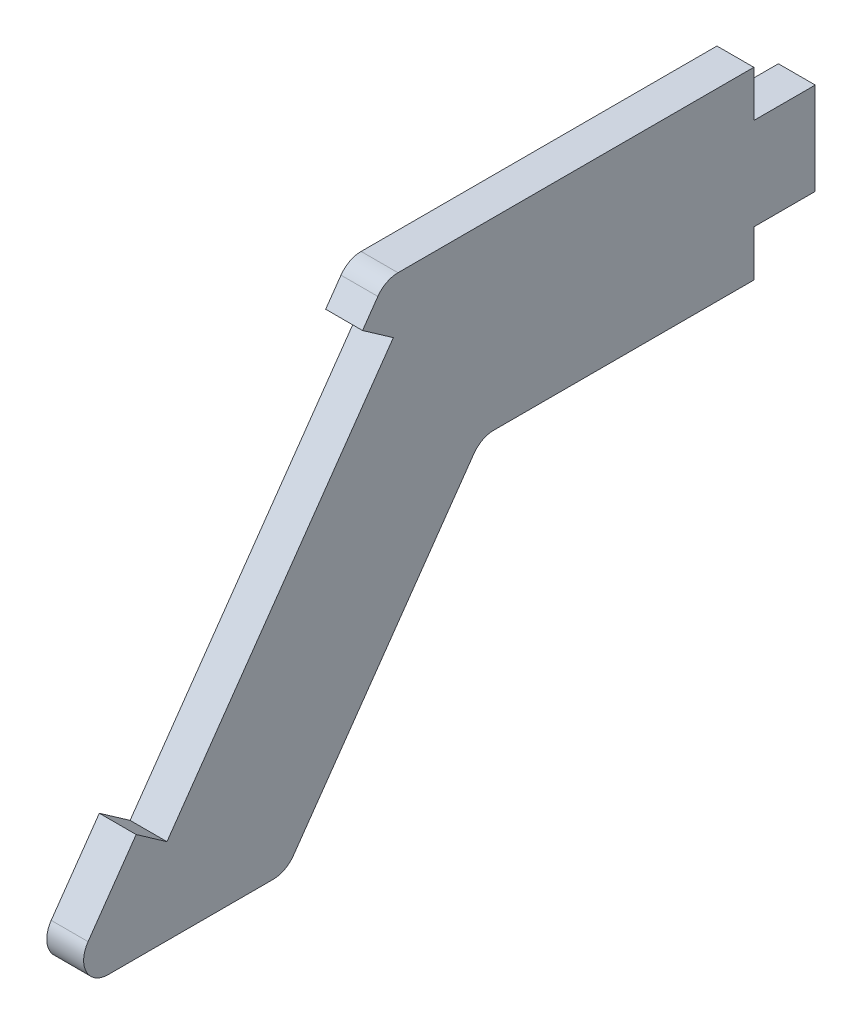
ISO-10303-21;
HEADER;
FILE_DESCRIPTION(('STEP AP214'),'2;1');
FILE_NAME('part.step','',(''),(''),'','','');
FILE_SCHEMA(('AUTOMOTIVE_DESIGN { 1 0 10303 214 1 1 1 1 }'));
ENDSEC;
DATA;
#1=APPLICATION_CONTEXT('core data for automotive mechanical design processes');
#2=APPLICATION_PROTOCOL_DEFINITION('international standard','automotive_design',2000,#1);
#3=PRODUCT_CONTEXT('',#1,'mechanical');
#4=PRODUCT('Part','Part','',(#3));
#5=PRODUCT_RELATED_PRODUCT_CATEGORY('part','',(#4));
#6=PRODUCT_DEFINITION_FORMATION('','',#4);
#7=PRODUCT_DEFINITION_CONTEXT('part definition',#1,'design');
#8=PRODUCT_DEFINITION('design','',#6,#7);
#9=PRODUCT_DEFINITION_SHAPE('','',#8);
#10=(LENGTH_UNIT() NAMED_UNIT(*) SI_UNIT(.MILLI.,.METRE.));
#11=(NAMED_UNIT(*) PLANE_ANGLE_UNIT() SI_UNIT($,.RADIAN.));
#12=(NAMED_UNIT(*) SI_UNIT($,.STERADIAN.) SOLID_ANGLE_UNIT());
#13=UNCERTAINTY_MEASURE_WITH_UNIT(LENGTH_MEASURE(1.E-05),#10,'distance_accuracy_value','');
#14=(GEOMETRIC_REPRESENTATION_CONTEXT(3) GLOBAL_UNCERTAINTY_ASSIGNED_CONTEXT((#13)) GLOBAL_UNIT_ASSIGNED_CONTEXT((#10,
#11,#12)) REPRESENTATION_CONTEXT('',''));
#15=CARTESIAN_POINT('',(0.,0.,0.));
#16=DIRECTION('',(0.,0.,1.));
#17=DIRECTION('',(1.,0.,0.));
#18=AXIS2_PLACEMENT_3D('',#15,#16,#17);
#19=CARTESIAN_POINT('',(3.,-100.457281175035,30.5971699874745));
#20=DIRECTION('',(0.,-0.573576436351044,-0.819152044288993));
#21=DIRECTION('',(0.,0.819152044288993,-0.573576436351044));
#22=AXIS2_PLACEMENT_3D('',#19,#20,#21);
#23=PLANE('',#22);
#24=DIRECTION('',(0.,-0.819152044288993,0.573576436351044));
#25=VECTOR('',#24,1.);
#26=CARTESIAN_POINT('',(3.,-100.457281175035,30.5971699874745));
#27=LINE('',#26,#25);
#28=CARTESIAN_POINT('',(3.,-128.547545188533,50.2661846000265));
#29=VERTEX_POINT('',#28);
#30=CARTESIAN_POINT('',(3.,-134.138275212329,54.1808559067837));
#31=VERTEX_POINT('',#30);
#32=EDGE_CURVE('E264',#29,#31,#27,.T.);
#33=ORIENTED_EDGE('',*,*,#32,.F.);
#34=DIRECTION('',(-1.,0.,0.));
#35=VECTOR('',#34,1.);
#36=CARTESIAN_POINT('',(38.011105568311,-128.547545188533,50.2661846000265));
#37=LINE('',#36,#35);
#38=CARTESIAN_POINT('',(0.,-128.547545188533,50.2661846000265));
#39=VERTEX_POINT('',#38);
#40=EDGE_CURVE('E305',#29,#39,#37,.T.);
#41=ORIENTED_EDGE('',*,*,#40,.T.);
#42=DIRECTION('',(0.,-0.819152044288993,0.573576436351044));
#43=VECTOR('',#42,1.);
#44=CARTESIAN_POINT('',(0.,-100.457281175035,30.5971699874745));
#45=LINE('',#44,#43);
#46=CARTESIAN_POINT('',(0.,-134.138275212329,54.1808559067837));
#47=VERTEX_POINT('',#46);
#48=EDGE_CURVE('E193',#39,#47,#45,.T.);
#49=ORIENTED_EDGE('',*,*,#48,.T.);
#50=DIRECTION('',(-1.,0.,0.));
#51=VECTOR('',#50,1.);
#52=CARTESIAN_POINT('',(3.,-134.138275212329,54.1808559067837));
#53=LINE('',#52,#51);
#54=EDGE_CURVE('E237',#31,#47,#53,.T.);
#55=ORIENTED_EDGE('',*,*,#54,.F.);
#56=EDGE_LOOP('',(#33,#41,#49,#55));
#57=FACE_BOUND('',#56,.T.);
#58=ADVANCED_FACE('F39',(#57),#23,.F.);
#59=CARTESIAN_POINT('',(3.,-99.6044340477375,0.));
#60=DIRECTION('',(0.,0.,1.));
#61=DIRECTION('',(0.,-1.,0.));
#62=AXIS2_PLACEMENT_3D('',#59,#60,#61);
#63=PLANE('',#62);
#64=DIRECTION('',(0.,1.,0.));
#65=VECTOR('',#64,1.);
#66=CARTESIAN_POINT('',(0.,-99.6044340477375,0.));
#67=LINE('',#66,#65);
#68=CARTESIAN_POINT('',(0.,-103.354434047738,0.));
#69=VERTEX_POINT('',#68);
#70=CARTESIAN_POINT('',(0.,-99.6044340477375,0.));
#71=VERTEX_POINT('',#70);
#72=EDGE_CURVE('E185',#69,#71,#67,.T.);
#73=ORIENTED_EDGE('',*,*,#72,.T.);
#74=DIRECTION('',(-1.,0.,0.));
#75=VECTOR('',#74,1.);
#76=CARTESIAN_POINT('',(3.,-99.6044340477375,0.));
#77=LINE('',#76,#75);
#78=CARTESIAN_POINT('',(3.,-99.6044340477375,0.));
#79=VERTEX_POINT('',#78);
#80=EDGE_CURVE('E11',#79,#71,#77,.T.);
#81=ORIENTED_EDGE('',*,*,#80,.F.);
#82=DIRECTION('',(0.,1.,0.));
#83=VECTOR('',#82,1.);
#84=CARTESIAN_POINT('',(3.,-99.6044340477375,0.));
#85=LINE('',#84,#83);
#86=CARTESIAN_POINT('',(3.,-103.354434047738,0.));
#87=VERTEX_POINT('',#86);
#88=EDGE_CURVE('E215',#87,#79,#85,.T.);
#89=ORIENTED_EDGE('',*,*,#88,.F.);
#90=DIRECTION('',(-1.,0.,0.));
#91=VECTOR('',#90,1.);
#92=CARTESIAN_POINT('',(3.,-103.354434047738,0.));
#93=LINE('',#92,#91);
#94=EDGE_CURVE('E181',#87,#69,#93,.T.);
#95=ORIENTED_EDGE('',*,*,#94,.T.);
#96=EDGE_LOOP('',(#73,#81,#89,#95));
#97=FACE_BOUND('',#96,.T.);
#98=ADVANCED_FACE('F41',(#97),#63,.F.);
#99=CARTESIAN_POINT('',(3.,-99.6044340477375,0.));
#100=DIRECTION('',(0.,-1.,0.));
#101=DIRECTION('',(0.,0.,-1.));
#102=AXIS2_PLACEMENT_3D('',#99,#100,#101);
#103=PLANE('',#102);
#104=DIRECTION('',(0.,0.,1.));
#105=VECTOR('',#104,1.);
#106=CARTESIAN_POINT('',(0.,-99.6044340477375,0.));
#107=LINE('',#106,#105);
#108=CARTESIAN_POINT('',(0.,-99.6044340477375,28.9588658988965));
#109=VERTEX_POINT('',#108);
#110=EDGE_CURVE('E188',#71,#109,#107,.T.);
#111=ORIENTED_EDGE('',*,*,#110,.T.);
#112=DIRECTION('',(-1.,0.,0.));
#113=VECTOR('',#112,1.);
#114=CARTESIAN_POINT('',(3.,-99.6044340477375,28.9588658988965));
#115=LINE('',#114,#113);
#116=CARTESIAN_POINT('',(3.,-99.6044340477375,28.9588658988965));
#117=VERTEX_POINT('',#116);
#118=EDGE_CURVE('E47',#117,#109,#115,.T.);
#119=ORIENTED_EDGE('',*,*,#118,.F.);
#120=DIRECTION('',(0.,0.,1.));
#121=VECTOR('',#120,1.);
#122=CARTESIAN_POINT('',(3.,-99.6044340477375,0.));
#123=LINE('',#122,#121);
#124=EDGE_CURVE('E122',#79,#117,#123,.T.);
#125=ORIENTED_EDGE('',*,*,#124,.F.);
#126=ORIENTED_EDGE('',*,*,#80,.T.);
#127=EDGE_LOOP('',(#111,#119,#125,#126));
#128=FACE_BOUND('',#127,.T.);
#129=ADVANCED_FACE('F376',(#128),#103,.F.);
#130=CARTESIAN_POINT('',(3.,-101.604434047738,28.9588658988965));
#131=DIRECTION('',(-1.,0.,0.));
#132=DIRECTION('',(0.,0.,1.));
#133=AXIS2_PLACEMENT_3D('',#130,#131,#132);
#134=CYLINDRICAL_SURFACE('',#133,2.);
#135=CARTESIAN_POINT('',(0.,-101.604434047738,28.9588658988965));
#136=DIRECTION('',(1.,0.,0.));
#137=DIRECTION('',(0.,0.,-1.));
#138=AXIS2_PLACEMENT_3D('',#135,#136,#137);
#139=CIRCLE('',#138,2.);
#140=CARTESIAN_POINT('',(0.,-100.457281175035,30.5971699874745));
#141=VERTEX_POINT('',#140);
#142=EDGE_CURVE('E191',#109,#141,#139,.T.);
#143=ORIENTED_EDGE('',*,*,#142,.T.);
#144=DIRECTION('',(-1.,0.,0.));
#145=VECTOR('',#144,1.);
#146=CARTESIAN_POINT('',(3.,-100.457281175035,30.5971699874745));
#147=LINE('',#146,#145);
#148=CARTESIAN_POINT('',(3.,-100.457281175035,30.5971699874745));
#149=VERTEX_POINT('',#148);
#150=EDGE_CURVE('E240',#149,#141,#147,.T.);
#151=ORIENTED_EDGE('',*,*,#150,.F.);
#152=CARTESIAN_POINT('',(3.,-101.604434047738,28.9588658988965));
#153=DIRECTION('',(1.,0.,0.));
#154=DIRECTION('',(0.,0.,-1.));
#155=AXIS2_PLACEMENT_3D('',#152,#153,#154);
#156=CIRCLE('',#155,2.);
#157=EDGE_CURVE('E248',#117,#149,#156,.T.);
#158=ORIENTED_EDGE('',*,*,#157,.F.);
#159=ORIENTED_EDGE('',*,*,#118,.T.);
#160=EDGE_LOOP('',(#143,#151,#158,#159));
#161=FACE_BOUND('',#160,.T.);
#162=ADVANCED_FACE('F246',(#161),#134,.T.);
#163=CARTESIAN_POINT('',(0.,-102.236381525971,31.8429094644309));
#164=VERTEX_POINT('',#163);
#165=EDGE_CURVE('E194',#141,#164,#45,.T.);
#166=ORIENTED_EDGE('',*,*,#165,.T.);
#167=DIRECTION('',(-1.,0.,0.));
#168=VECTOR('',#167,1.);
#169=CARTESIAN_POINT('',(38.011105568311,-102.236381525971,31.8429094644309));
#170=LINE('',#169,#168);
#171=CARTESIAN_POINT('',(3.,-102.236381525971,31.8429094644309));
#172=VERTEX_POINT('',#171);
#173=EDGE_CURVE('E54',#172,#164,#170,.T.);
#174=ORIENTED_EDGE('',*,*,#173,.F.);
#175=EDGE_CURVE('E261',#149,#172,#27,.T.);
#176=ORIENTED_EDGE('',*,*,#175,.F.);
#177=ORIENTED_EDGE('',*,*,#150,.T.);
#178=EDGE_LOOP('',(#166,#174,#176,#177));
#179=FACE_BOUND('',#178,.T.);
#180=ADVANCED_FACE('F257',(#179),#23,.F.);
#181=CARTESIAN_POINT('',(3.,-135.285428085031,52.5425518182057));
#182=DIRECTION('',(-1.,0.,0.));
#183=DIRECTION('',(0.,0.,1.));
#184=AXIS2_PLACEMENT_3D('',#181,#182,#183);
#185=CYLINDRICAL_SURFACE('',#184,2.);
#186=CARTESIAN_POINT('',(0.,-135.285428085031,52.5425518182057));
#187=DIRECTION('',(1.,0.,0.));
#188=DIRECTION('',(0.,0.,-1.));
#189=AXIS2_PLACEMENT_3D('',#186,#187,#188);
#190=CIRCLE('',#189,2.);
#191=CARTESIAN_POINT('',(0.,-137.285428085031,52.5425518182057));
#192=VERTEX_POINT('',#191);
#193=EDGE_CURVE('E197',#47,#192,#190,.T.);
#194=ORIENTED_EDGE('',*,*,#193,.T.);
#195=DIRECTION('',(-1.,0.,0.));
#196=VECTOR('',#195,1.);
#197=CARTESIAN_POINT('',(3.,-137.285428085031,52.5425518182057));
#198=LINE('',#197,#196);
#199=CARTESIAN_POINT('',(3.,-137.285428085031,52.5425518182057));
#200=VERTEX_POINT('',#199);
#201=EDGE_CURVE('E234',#200,#192,#198,.T.);
#202=ORIENTED_EDGE('',*,*,#201,.F.);
#203=CARTESIAN_POINT('',(3.,-135.285428085031,52.5425518182057));
#204=DIRECTION('',(1.,0.,0.));
#205=DIRECTION('',(0.,0.,-1.));
#206=AXIS2_PLACEMENT_3D('',#203,#204,#205);
#207=CIRCLE('',#206,2.);
#208=EDGE_CURVE('E263',#31,#200,#207,.T.);
#209=ORIENTED_EDGE('',*,*,#208,.F.);
#210=ORIENTED_EDGE('',*,*,#54,.T.);
#211=EDGE_LOOP('',(#194,#202,#209,#210));
#212=FACE_BOUND('',#211,.T.);
#213=ADVANCED_FACE('F344',(#212),#185,.T.);
#214=CARTESIAN_POINT('',(3.,-137.285428085031,52.5425518182057));
#215=DIRECTION('',(0.,1.,0.));
#216=DIRECTION('',(0.,0.,1.));
#217=AXIS2_PLACEMENT_3D('',#214,#215,#216);
#218=PLANE('',#217);
#219=DIRECTION('',(0.,0.,-1.));
#220=VECTOR('',#219,1.);
#221=CARTESIAN_POINT('',(0.,-137.285428085031,52.5425518182057));
#222=LINE('',#221,#220);
#223=CARTESIAN_POINT('',(0.,-137.285428085031,39.1140313418297));
#224=VERTEX_POINT('',#223);
#225=EDGE_CURVE('E199',#192,#224,#222,.T.);
#226=ORIENTED_EDGE('',*,*,#225,.T.);
#227=DIRECTION('',(-1.,0.,0.));
#228=VECTOR('',#227,1.);
#229=CARTESIAN_POINT('',(3.,-137.285428085031,39.1140313418297));
#230=LINE('',#229,#228);
#231=CARTESIAN_POINT('',(3.,-137.285428085031,39.1140313418297));
#232=VERTEX_POINT('',#231);
#233=EDGE_CURVE('E231',#232,#224,#230,.T.);
#234=ORIENTED_EDGE('',*,*,#233,.F.);
#235=DIRECTION('',(0.,0.,-1.));
#236=VECTOR('',#235,1.);
#237=CARTESIAN_POINT('',(3.,-137.285428085031,52.5425518182057));
#238=LINE('',#237,#236);
#239=EDGE_CURVE('E266',#200,#232,#238,.T.);
#240=ORIENTED_EDGE('',*,*,#239,.F.);
#241=ORIENTED_EDGE('',*,*,#201,.T.);
#242=EDGE_LOOP('',(#226,#234,#240,#241));
#243=FACE_BOUND('',#242,.T.);
#244=ADVANCED_FACE('F350',(#243),#218,.F.);
#245=CARTESIAN_POINT('',(3.,-135.285428085031,39.1140313418297));
#246=DIRECTION('',(-1.,0.,0.));
#247=DIRECTION('',(0.,0.,1.));
#248=AXIS2_PLACEMENT_3D('',#245,#246,#247);
#249=CYLINDRICAL_SURFACE('',#248,1.99999999999999);
#250=CARTESIAN_POINT('',(0.,-135.285428085031,39.1140313418297));
#251=DIRECTION('',(1.,0.,0.));
#252=DIRECTION('',(0.,0.,-1.));
#253=AXIS2_PLACEMENT_3D('',#250,#251,#252);
#254=CIRCLE('',#253,1.99999999999999);
#255=CARTESIAN_POINT('',(0.,-136.432580957733,37.4757272532517));
#256=VERTEX_POINT('',#255);
#257=EDGE_CURVE('E201',#224,#256,#254,.T.);
#258=ORIENTED_EDGE('',*,*,#257,.T.);
#259=DIRECTION('',(-1.,0.,0.));
#260=VECTOR('',#259,1.);
#261=CARTESIAN_POINT('',(3.,-136.432580957733,37.4757272532517));
#262=LINE('',#261,#260);
#263=CARTESIAN_POINT('',(3.,-136.432580957733,37.4757272532517));
#264=VERTEX_POINT('',#263);
#265=EDGE_CURVE('E228',#264,#256,#262,.T.);
#266=ORIENTED_EDGE('',*,*,#265,.F.);
#267=CARTESIAN_POINT('',(3.,-135.285428085031,39.1140313418297));
#268=DIRECTION('',(1.,0.,0.));
#269=DIRECTION('',(0.,0.,-1.));
#270=AXIS2_PLACEMENT_3D('',#267,#268,#269);
#271=CIRCLE('',#270,1.99999999999999);
#272=EDGE_CURVE('E272',#232,#264,#271,.T.);
#273=ORIENTED_EDGE('',*,*,#272,.F.);
#274=ORIENTED_EDGE('',*,*,#233,.T.);
#275=EDGE_LOOP('',(#258,#266,#273,#274));
#276=FACE_BOUND('',#275,.T.);
#277=ADVANCED_FACE('F354',(#276),#249,.T.);
#278=CARTESIAN_POINT('',(3.,-136.432580957733,37.4757272532517));
#279=DIRECTION('',(0.,0.573576436351043,0.819152044288994));
#280=DIRECTION('',(0.,-0.819152044288994,0.573576436351043));
#281=AXIS2_PLACEMENT_3D('',#278,#279,#280);
#282=PLANE('',#281);
#283=DIRECTION('',(0.,0.819152044288994,-0.573576436351043));
#284=VECTOR('',#283,1.);
#285=CARTESIAN_POINT('',(0.,-136.432580957733,37.4757272532517));
#286=LINE('',#285,#284);
#287=CARTESIAN_POINT('',(0.,-115.457281175035,22.7886642291983));
#288=VERTEX_POINT('',#287);
#289=EDGE_CURVE('E203',#256,#288,#286,.T.);
#290=ORIENTED_EDGE('',*,*,#289,.T.);
#291=DIRECTION('',(-1.,0.,0.));
#292=VECTOR('',#291,1.);
#293=CARTESIAN_POINT('',(3.,-115.457281175035,22.7886642291983));
#294=LINE('',#293,#292);
#295=CARTESIAN_POINT('',(3.,-115.457281175035,22.7886642291983));
#296=VERTEX_POINT('',#295);
#297=EDGE_CURVE('E225',#296,#288,#294,.T.);
#298=ORIENTED_EDGE('',*,*,#297,.F.);
#299=DIRECTION('',(0.,0.819152044288994,-0.573576436351043));
#300=VECTOR('',#299,1.);
#301=CARTESIAN_POINT('',(3.,-136.432580957733,37.4757272532517));
#302=LINE('',#301,#300);
#303=EDGE_CURVE('E274',#264,#296,#302,.T.);
#304=ORIENTED_EDGE('',*,*,#303,.F.);
#305=ORIENTED_EDGE('',*,*,#265,.T.);
#306=EDGE_LOOP('',(#290,#298,#304,#305));
#307=FACE_BOUND('',#306,.T.);
#308=ADVANCED_FACE('F359',(#307),#282,.F.);
#309=CARTESIAN_POINT('',(3.,-116.604434047738,21.1503601406203));
#310=DIRECTION('',(-1.,0.,0.));
#311=DIRECTION('',(0.,0.,1.));
#312=AXIS2_PLACEMENT_3D('',#309,#310,#311);
#313=CYLINDRICAL_SURFACE('',#312,2.00000000000001);
#314=CARTESIAN_POINT('',(0.,-116.604434047738,21.1503601406203));
#315=DIRECTION('',(-1.,0.,0.));
#316=DIRECTION('',(0.,0.,1.));
#317=AXIS2_PLACEMENT_3D('',#314,#315,#316);
#318=CIRCLE('',#317,2.00000000000001);
#319=CARTESIAN_POINT('',(0.,-114.604434047738,21.1503601406203));
#320=VERTEX_POINT('',#319);
#321=EDGE_CURVE('E205',#288,#320,#318,.T.);
#322=ORIENTED_EDGE('',*,*,#321,.T.);
#323=DIRECTION('',(-1.,0.,0.));
#324=VECTOR('',#323,1.);
#325=CARTESIAN_POINT('',(3.,-114.604434047738,21.1503601406203));
#326=LINE('',#325,#324);
#327=CARTESIAN_POINT('',(3.,-114.604434047738,21.1503601406203));
#328=VERTEX_POINT('',#327);
#329=EDGE_CURVE('E222',#328,#320,#326,.T.);
#330=ORIENTED_EDGE('',*,*,#329,.F.);
#331=CARTESIAN_POINT('',(3.,-116.604434047738,21.1503601406203));
#332=DIRECTION('',(-1.,0.,0.));
#333=DIRECTION('',(0.,0.,1.));
#334=AXIS2_PLACEMENT_3D('',#331,#332,#333);
#335=CIRCLE('',#334,2.00000000000001);
#336=EDGE_CURVE('E276',#296,#328,#335,.T.);
#337=ORIENTED_EDGE('',*,*,#336,.F.);
#338=ORIENTED_EDGE('',*,*,#297,.T.);
#339=EDGE_LOOP('',(#322,#330,#337,#338));
#340=FACE_BOUND('',#339,.T.);
#341=ADVANCED_FACE('F362',(#340),#313,.F.);
#342=CARTESIAN_POINT('',(3.,-114.604434047738,21.1503601406203));
#343=DIRECTION('',(0.,1.,0.));
#344=DIRECTION('',(0.,0.,1.));
#345=AXIS2_PLACEMENT_3D('',#342,#343,#344);
#346=PLANE('',#345);
#347=DIRECTION('',(0.,0.,-1.));
#348=VECTOR('',#347,1.);
#349=CARTESIAN_POINT('',(0.,-114.604434047738,21.1503601406203));
#350=LINE('',#349,#348);
#351=CARTESIAN_POINT('',(0.,-114.604434047738,0.));
#352=VERTEX_POINT('',#351);
#353=EDGE_CURVE('E207',#320,#352,#350,.T.);
#354=ORIENTED_EDGE('',*,*,#353,.T.);
#355=DIRECTION('',(-1.,0.,0.));
#356=VECTOR('',#355,1.);
#357=CARTESIAN_POINT('',(3.,-114.604434047738,0.));
#358=LINE('',#357,#356);
#359=CARTESIAN_POINT('',(3.,-114.604434047738,0.));
#360=VERTEX_POINT('',#359);
#361=EDGE_CURVE('E219',#360,#352,#358,.T.);
#362=ORIENTED_EDGE('',*,*,#361,.F.);
#363=DIRECTION('',(0.,0.,-1.));
#364=VECTOR('',#363,1.);
#365=CARTESIAN_POINT('',(3.,-114.604434047738,21.1503601406203));
#366=LINE('',#365,#364);
#367=EDGE_CURVE('E278',#328,#360,#366,.T.);
#368=ORIENTED_EDGE('',*,*,#367,.F.);
#369=ORIENTED_EDGE('',*,*,#329,.T.);
#370=EDGE_LOOP('',(#354,#362,#368,#369));
#371=FACE_BOUND('',#370,.T.);
#372=ADVANCED_FACE('F284',(#371),#346,.F.);
#373=CARTESIAN_POINT('',(3.,-110.854434047738,0.));
#374=DIRECTION('',(0.,0.,1.));
#375=DIRECTION('',(0.,-1.,0.));
#376=AXIS2_PLACEMENT_3D('',#373,#374,#375);
#377=PLANE('',#376);
#378=DIRECTION('',(0.,1.,0.));
#379=VECTOR('',#378,1.);
#380=CARTESIAN_POINT('',(0.,-110.854434047738,0.));
#381=LINE('',#380,#379);
#382=CARTESIAN_POINT('',(0.,-110.854434047738,0.));
#383=VERTEX_POINT('',#382);
#384=EDGE_CURVE('E209',#352,#383,#381,.T.);
#385=ORIENTED_EDGE('',*,*,#384,.T.);
#386=DIRECTION('',(-1.,0.,0.));
#387=VECTOR('',#386,1.);
#388=CARTESIAN_POINT('',(3.,-110.854434047738,0.));
#389=LINE('',#388,#387);
#390=CARTESIAN_POINT('',(3.,-110.854434047738,0.));
#391=VERTEX_POINT('',#390);
#392=EDGE_CURVE('E176',#391,#383,#389,.T.);
#393=ORIENTED_EDGE('',*,*,#392,.F.);
#394=DIRECTION('',(0.,1.,0.));
#395=VECTOR('',#394,1.);
#396=CARTESIAN_POINT('',(3.,-110.854434047738,0.));
#397=LINE('',#396,#395);
#398=EDGE_CURVE('E164',#360,#391,#397,.T.);
#399=ORIENTED_EDGE('',*,*,#398,.F.);
#400=ORIENTED_EDGE('',*,*,#361,.T.);
#401=EDGE_LOOP('',(#385,#393,#399,#400));
#402=FACE_BOUND('',#401,.T.);
#403=ADVANCED_FACE('F288',(#402),#377,.F.);
#404=CARTESIAN_POINT('',(3.,-110.854434047738,0.));
#405=DIRECTION('',(0.,1.,0.));
#406=DIRECTION('',(0.,0.,1.));
#407=AXIS2_PLACEMENT_3D('',#404,#405,#406);
#408=PLANE('',#407);
#409=DIRECTION('',(0.,0.,-1.));
#410=VECTOR('',#409,1.);
#411=CARTESIAN_POINT('',(0.,-110.854434047738,0.));
#412=LINE('',#411,#410);
#413=CARTESIAN_POINT('',(0.,-110.854434047738,-5.));
#414=VERTEX_POINT('',#413);
#415=EDGE_CURVE('E173',#383,#414,#412,.T.);
#416=ORIENTED_EDGE('',*,*,#415,.T.);
#417=DIRECTION('',(-1.,0.,0.));
#418=VECTOR('',#417,1.);
#419=CARTESIAN_POINT('',(3.,-110.854434047738,-5.));
#420=LINE('',#419,#418);
#421=CARTESIAN_POINT('',(3.,-110.854434047738,-5.));
#422=VERTEX_POINT('',#421);
#423=EDGE_CURVE('E170',#422,#414,#420,.T.);
#424=ORIENTED_EDGE('',*,*,#423,.F.);
#425=DIRECTION('',(0.,0.,-1.));
#426=VECTOR('',#425,1.);
#427=CARTESIAN_POINT('',(3.,-110.854434047738,0.));
#428=LINE('',#427,#426);
#429=EDGE_CURVE('E156',#391,#422,#428,.T.);
#430=ORIENTED_EDGE('',*,*,#429,.F.);
#431=ORIENTED_EDGE('',*,*,#392,.T.);
#432=EDGE_LOOP('',(#416,#424,#430,#431));
#433=FACE_BOUND('',#432,.T.);
#434=ADVANCED_FACE('F171',(#433),#408,.F.);
#435=CARTESIAN_POINT('',(3.,-103.354434047738,-5.));
#436=DIRECTION('',(0.,0.,1.));
#437=DIRECTION('',(1.,0.,0.));
#438=AXIS2_PLACEMENT_3D('',#435,#436,#437);
#439=PLANE('',#438);
#440=DIRECTION('',(0.,1.,0.));
#441=VECTOR('',#440,1.);
#442=CARTESIAN_POINT('',(0.,-103.354434047738,-5.));
#443=LINE('',#442,#441);
#444=CARTESIAN_POINT('',(0.,-103.354434047738,-5.));
#445=VERTEX_POINT('',#444);
#446=EDGE_CURVE('E212',#414,#445,#443,.T.);
#447=ORIENTED_EDGE('',*,*,#446,.T.);
#448=DIRECTION('',(-1.,0.,0.));
#449=VECTOR('',#448,1.);
#450=CARTESIAN_POINT('',(3.,-103.354434047738,-5.));
#451=LINE('',#450,#449);
#452=CARTESIAN_POINT('',(3.,-103.354434047738,-5.));
#453=VERTEX_POINT('',#452);
#454=EDGE_CURVE('E177',#453,#445,#451,.T.);
#455=ORIENTED_EDGE('',*,*,#454,.F.);
#456=DIRECTION('',(0.,1.,0.));
#457=VECTOR('',#456,1.);
#458=CARTESIAN_POINT('',(3.,-103.354434047738,-5.));
#459=LINE('',#458,#457);
#460=EDGE_CURVE('E161',#422,#453,#459,.T.);
#461=ORIENTED_EDGE('',*,*,#460,.F.);
#462=ORIENTED_EDGE('',*,*,#423,.T.);
#463=EDGE_LOOP('',(#447,#455,#461,#462));
#464=FACE_BOUND('',#463,.T.);
#465=ADVANCED_FACE('F179',(#464),#439,.F.);
#466=CARTESIAN_POINT('',(3.,-103.354434047738,0.));
#467=DIRECTION('',(0.,-1.,0.));
#468=DIRECTION('',(0.,0.,-1.));
#469=AXIS2_PLACEMENT_3D('',#466,#467,#468);
#470=PLANE('',#469);
#471=DIRECTION('',(0.,0.,1.));
#472=VECTOR('',#471,1.);
#473=CARTESIAN_POINT('',(0.,-103.354434047738,0.));
#474=LINE('',#473,#472);
#475=EDGE_CURVE('E114',#445,#69,#474,.T.);
#476=ORIENTED_EDGE('',*,*,#475,.T.);
#477=ORIENTED_EDGE('',*,*,#94,.F.);
#478=DIRECTION('',(0.,0.,1.));
#479=VECTOR('',#478,1.);
#480=CARTESIAN_POINT('',(3.,-103.354434047738,0.));
#481=LINE('',#480,#479);
#482=EDGE_CURVE('E63',#453,#87,#481,.T.);
#483=ORIENTED_EDGE('',*,*,#482,.F.);
#484=ORIENTED_EDGE('',*,*,#454,.T.);
#485=EDGE_LOOP('',(#476,#477,#483,#484));
#486=FACE_BOUND('',#485,.T.);
#487=ADVANCED_FACE('F289',(#486),#470,.F.);
#488=CARTESIAN_POINT('',(3.,-116.604434047738,21.1503601406203));
#489=DIRECTION('',(-1.,0.,0.));
#490=DIRECTION('',(0.,0.,1.));
#491=AXIS2_PLACEMENT_3D('',#488,#489,#490);
#492=PLANE('',#491);
#493=DIRECTION('',(0.,0.819152044288994,-0.573576436351044));
#494=VECTOR('',#493,1.);
#495=CARTESIAN_POINT('',(3.,-103.991525421205,29.3363042089066));
#496=LINE('',#495,#494);
#497=CARTESIAN_POINT('',(3.,-130.302689083767,47.7595793445021));
#498=VERTEX_POINT('',#497);
#499=CARTESIAN_POINT('',(3.,-103.991525421205,29.3363042089066));
#500=VERTEX_POINT('',#499);
#501=EDGE_CURVE('E308',#498,#500,#496,.T.);
#502=ORIENTED_EDGE('',*,*,#501,.F.);
#503=DIRECTION('',(0.,-0.573576436351053,-0.819152044288987));
#504=VECTOR('',#503,1.);
#505=CARTESIAN_POINT('',(3.,-128.547545188533,50.2661846000265));
#506=LINE('',#505,#504);
#507=EDGE_CURVE('E296',#29,#498,#506,.T.);
#508=ORIENTED_EDGE('',*,*,#507,.F.);
#509=ORIENTED_EDGE('',*,*,#32,.T.);
#510=ORIENTED_EDGE('',*,*,#208,.T.);
#511=ORIENTED_EDGE('',*,*,#239,.T.);
#512=ORIENTED_EDGE('',*,*,#272,.T.);
#513=ORIENTED_EDGE('',*,*,#303,.T.);
#514=ORIENTED_EDGE('',*,*,#336,.T.);
#515=ORIENTED_EDGE('',*,*,#367,.T.);
#516=ORIENTED_EDGE('',*,*,#398,.T.);
#517=ORIENTED_EDGE('',*,*,#429,.T.);
#518=ORIENTED_EDGE('',*,*,#460,.T.);
#519=ORIENTED_EDGE('',*,*,#482,.T.);
#520=ORIENTED_EDGE('',*,*,#88,.T.);
#521=ORIENTED_EDGE('',*,*,#124,.T.);
#522=ORIENTED_EDGE('',*,*,#157,.T.);
#523=ORIENTED_EDGE('',*,*,#175,.T.);
#524=DIRECTION('',(0.,0.573576436351043,0.819152044288994));
#525=VECTOR('',#524,1.);
#526=CARTESIAN_POINT('',(3.,-102.236381525971,31.8429094644309));
#527=LINE('',#526,#525);
#528=EDGE_CURVE('E189',#500,#172,#527,.T.);
#529=ORIENTED_EDGE('',*,*,#528,.F.);
#530=EDGE_LOOP('',(#502,#508,#509,#510,#511,#512,#513,#514,#515,#516,#517,#518,#519,#520,#521,
#522,#523,#529));
#531=FACE_BOUND('',#530,.T.);
#532=ADVANCED_FACE('F159',(#531),#492,.F.);
#533=CARTESIAN_POINT('',(0.,-116.604434047738,21.1503601406203));
#534=DIRECTION('',(-1.,0.,0.));
#535=DIRECTION('',(0.,0.,1.));
#536=AXIS2_PLACEMENT_3D('',#533,#534,#535);
#537=PLANE('',#536);
#538=DIRECTION('',(0.,0.573576436351053,0.819152044288987));
#539=VECTOR('',#538,1.);
#540=CARTESIAN_POINT('',(0.,-128.547545188533,50.2661846000265));
#541=LINE('',#540,#539);
#542=CARTESIAN_POINT('',(0.,-130.302689083767,47.7595793445021));
#543=VERTEX_POINT('',#542);
#544=EDGE_CURVE('E299',#543,#39,#541,.T.);
#545=ORIENTED_EDGE('',*,*,#544,.F.);
#546=DIRECTION('',(0.,-0.819152044288994,0.573576436351043));
#547=VECTOR('',#546,1.);
#548=CARTESIAN_POINT('',(0.,-103.991525421205,29.3363042089066));
#549=LINE('',#548,#547);
#550=CARTESIAN_POINT('',(0.,-103.991525421205,29.3363042089066));
#551=VERTEX_POINT('',#550);
#552=EDGE_CURVE('E311',#551,#543,#549,.T.);
#553=ORIENTED_EDGE('',*,*,#552,.F.);
#554=DIRECTION('',(0.,-0.573576436351043,-0.819152044288994));
#555=VECTOR('',#554,1.);
#556=CARTESIAN_POINT('',(0.,-102.236381525971,31.8429094644309));
#557=LINE('',#556,#555);
#558=EDGE_CURVE('E255',#164,#551,#557,.T.);
#559=ORIENTED_EDGE('',*,*,#558,.F.);
#560=ORIENTED_EDGE('',*,*,#165,.F.);
#561=ORIENTED_EDGE('',*,*,#142,.F.);
#562=ORIENTED_EDGE('',*,*,#110,.F.);
#563=ORIENTED_EDGE('',*,*,#72,.F.);
#564=ORIENTED_EDGE('',*,*,#475,.F.);
#565=ORIENTED_EDGE('',*,*,#446,.F.);
#566=ORIENTED_EDGE('',*,*,#415,.F.);
#567=ORIENTED_EDGE('',*,*,#384,.F.);
#568=ORIENTED_EDGE('',*,*,#353,.F.);
#569=ORIENTED_EDGE('',*,*,#321,.F.);
#570=ORIENTED_EDGE('',*,*,#289,.F.);
#571=ORIENTED_EDGE('',*,*,#257,.F.);
#572=ORIENTED_EDGE('',*,*,#225,.F.);
#573=ORIENTED_EDGE('',*,*,#193,.F.);
#574=ORIENTED_EDGE('',*,*,#48,.F.);
#575=EDGE_LOOP('',(#545,#553,#559,#560,#561,#562,#563,#564,#565,#566,#567,#568,#569,#570,#571,
#572,#573,#574));
#576=FACE_BOUND('',#575,.T.);
#577=ADVANCED_FACE('F252',(#576),#537,.T.);
#578=CARTESIAN_POINT('',(38.011105568311,-128.547545188533,50.2661846000265));
#579=DIRECTION('',(0.,-0.819152044288987,0.573576436351053));
#580=DIRECTION('',(0.,-0.573576436351053,-0.819152044288987));
#581=AXIS2_PLACEMENT_3D('',#578,#579,#580);
#582=PLANE('',#581);
#583=ORIENTED_EDGE('',*,*,#507,.T.);
#584=DIRECTION('',(-1.,0.,0.));
#585=VECTOR('',#584,1.);
#586=CARTESIAN_POINT('',(38.011105568311,-130.302689083767,47.7595793445021));
#587=LINE('',#586,#585);
#588=EDGE_CURVE('E302',#498,#543,#587,.T.);
#589=ORIENTED_EDGE('',*,*,#588,.T.);
#590=ORIENTED_EDGE('',*,*,#544,.T.);
#591=ORIENTED_EDGE('',*,*,#40,.F.);
#592=EDGE_LOOP('',(#583,#589,#590,#591));
#593=FACE_BOUND('',#592,.T.);
#594=ADVANCED_FACE('F336',(#593),#582,.F.);
#595=CARTESIAN_POINT('',(38.011105568311,-103.991525421205,29.3363042089066));
#596=DIRECTION('',(0.,-0.573576436351044,-0.819152044288994));
#597=DIRECTION('',(0.,0.819152044288994,-0.573576436351044));
#598=AXIS2_PLACEMENT_3D('',#595,#596,#597);
#599=PLANE('',#598);
#600=ORIENTED_EDGE('',*,*,#501,.T.);
#601=DIRECTION('',(-1.,0.,0.));
#602=VECTOR('',#601,1.);
#603=CARTESIAN_POINT('',(38.011105568311,-103.991525421205,29.3363042089066));
#604=LINE('',#603,#602);
#605=EDGE_CURVE('E298',#500,#551,#604,.T.);
#606=ORIENTED_EDGE('',*,*,#605,.T.);
#607=ORIENTED_EDGE('',*,*,#552,.T.);
#608=ORIENTED_EDGE('',*,*,#588,.F.);
#609=EDGE_LOOP('',(#600,#606,#607,#608));
#610=FACE_BOUND('',#609,.T.);
#611=ADVANCED_FACE('F322',(#610),#599,.F.);
#612=CARTESIAN_POINT('',(38.011105568311,-102.236381525971,31.8429094644309));
#613=DIRECTION('',(0.,0.819152044288994,-0.573576436351043));
#614=DIRECTION('',(0.,0.573576436351043,0.819152044288994));
#615=AXIS2_PLACEMENT_3D('',#612,#613,#614);
#616=PLANE('',#615);
#617=ORIENTED_EDGE('',*,*,#528,.T.);
#618=ORIENTED_EDGE('',*,*,#173,.T.);
#619=ORIENTED_EDGE('',*,*,#558,.T.);
#620=ORIENTED_EDGE('',*,*,#605,.F.);
#621=EDGE_LOOP('',(#617,#618,#619,#620));
#622=FACE_BOUND('',#621,.T.);
#623=ADVANCED_FACE('F327',(#622),#616,.F.);
#624=CLOSED_SHELL('',(#58,#98,#129,#162,#180,#213,#244,#277,#308,#341,#372,#403,#434,#465,#487,
#532,#577,#594,#611,#623));
#625=MANIFOLD_SOLID_BREP('B2',#624);
#626=ADVANCED_BREP_SHAPE_REPRESENTATION('',(#18,#625),#14);
#627=SHAPE_DEFINITION_REPRESENTATION(#9,#626);
ENDSEC;
END-ISO-10303-21;
